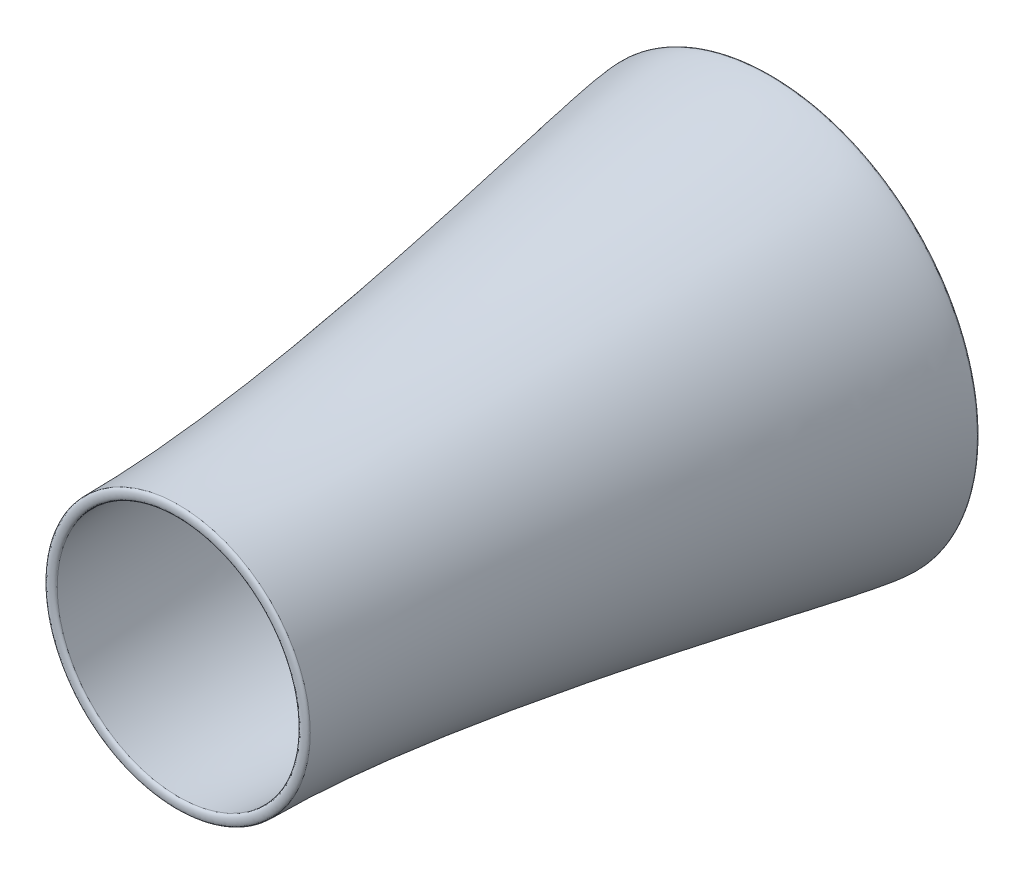
ISO-10303-21;
HEADER;
FILE_DESCRIPTION(('STEP AP214'),'2;1');
FILE_NAME('part.step','',(''),(''),'','','');
FILE_SCHEMA(('AUTOMOTIVE_DESIGN { 1 0 10303 214 1 1 1 1 }'));
ENDSEC;
DATA;
#1=APPLICATION_CONTEXT('core data for automotive mechanical design processes');
#2=APPLICATION_PROTOCOL_DEFINITION('international standard','automotive_design',2000,#1);
#3=PRODUCT_CONTEXT('',#1,'mechanical');
#4=PRODUCT('Part','Part','',(#3));
#5=PRODUCT_RELATED_PRODUCT_CATEGORY('part','',(#4));
#6=PRODUCT_DEFINITION_FORMATION('','',#4);
#7=PRODUCT_DEFINITION_CONTEXT('part definition',#1,'design');
#8=PRODUCT_DEFINITION('design','',#6,#7);
#9=PRODUCT_DEFINITION_SHAPE('','',#8);
#10=(LENGTH_UNIT() NAMED_UNIT(*) SI_UNIT(.MILLI.,.METRE.));
#11=(NAMED_UNIT(*) PLANE_ANGLE_UNIT() SI_UNIT($,.RADIAN.));
#12=(NAMED_UNIT(*) SI_UNIT($,.STERADIAN.) SOLID_ANGLE_UNIT());
#13=UNCERTAINTY_MEASURE_WITH_UNIT(LENGTH_MEASURE(1.E-05),#10,'distance_accuracy_value','');
#14=(GEOMETRIC_REPRESENTATION_CONTEXT(3) GLOBAL_UNCERTAINTY_ASSIGNED_CONTEXT((#13)) GLOBAL_UNIT_ASSIGNED_CONTEXT((#10,
#11,#12)) REPRESENTATION_CONTEXT('',''));
#15=CARTESIAN_POINT('',(0.,0.,0.));
#16=DIRECTION('',(0.,0.,1.));
#17=DIRECTION('',(1.,0.,0.));
#18=AXIS2_PLACEMENT_3D('',#15,#16,#17);
#19=CARTESIAN_POINT('',(-450.143329298044,0.,2018.65939694511));
#20=CARTESIAN_POINT('',(-450.143329298044,0.,2031.35939694511));
#21=CARTESIAN_POINT('',(-414.489662378919,0.,2031.35939694511));
#22=CARTESIAN_POINT('',(-414.489662378919,0.,2018.65939694511));
#23=B_SPLINE_CURVE_WITH_KNOTS('',3,(#19,#20,#21,#22),.UNSPECIFIED.,.F.,.F.,(4,4),(0.,1.),.UNSPECIFIED.);
#24=CARTESIAN_POINT('',(0.,0.,1104.75683012291));
#25=DIRECTION('',(0.,0.,1.));
#26=AXIS1_PLACEMENT('',#24,#25);
#27=SURFACE_OF_REVOLUTION('',#23,#26);
#28=CARTESIAN_POINT('',(0.,0.,2018.65939694511));
#29=DIRECTION('',(0.,0.,1.));
#30=DIRECTION('',(1.,0.,0.));
#31=AXIS2_PLACEMENT_3D('',#28,#29,#30);
#32=CIRCLE('',#31,414.489662378919);
#33=CARTESIAN_POINT('',(414.489662378919,0.,2018.65939694511));
#34=VERTEX_POINT('',#33);
#35=EDGE_CURVE('E47',#34,#34,#32,.T.);
#36=ORIENTED_EDGE('',*,*,#35,.F.);
#37=EDGE_LOOP('',(#36));
#38=FACE_BOUND('',#37,.T.);
#39=CARTESIAN_POINT('',(0.,0.,2018.65939694511));
#40=DIRECTION('',(0.,0.,1.));
#41=DIRECTION('',(1.,0.,0.));
#42=AXIS2_PLACEMENT_3D('',#39,#40,#41);
#43=CIRCLE('',#42,450.143329298044);
#44=CARTESIAN_POINT('',(450.143329298044,0.,2018.65939694511));
#45=VERTEX_POINT('',#44);
#46=EDGE_CURVE('E11',#45,#45,#43,.T.);
#47=ORIENTED_EDGE('',*,*,#46,.T.);
#48=EDGE_LOOP('',(#47));
#49=FACE_BOUND('',#48,.T.);
#50=ADVANCED_FACE('F40',(#38,#49),#27,.T.);
#51=CARTESIAN_POINT('',(-450.143329298044,0.,2018.65939694511));
#52=DIRECTION('',(0.,0.,1.));
#53=DIRECTION('',(1.,0.,0.));
#54=AXIS2_PLACEMENT_3D('',#51,#52,#53);
#55=PLANE('',#54);
#56=ORIENTED_EDGE('',*,*,#46,.F.);
#57=EDGE_LOOP('',(#56));
#58=FACE_BOUND('',#57,.T.);
#59=ORIENTED_EDGE('',*,*,#35,.T.);
#60=EDGE_LOOP('',(#59));
#61=FACE_BOUND('',#60,.T.);
#62=ADVANCED_FACE('F59',(#58,#61),#55,.F.);
#63=CLOSED_SHELL('',(#50,#62));
#64=MANIFOLD_SOLID_BREP('B2',#63);
#65=CARTESIAN_POINT('',(-622.148368511565,0.,0.89375987334962));
#66=CARTESIAN_POINT('',(-622.148368511565,0.,-16.0395734599839));
#67=CARTESIAN_POINT('',(-711.609923736489,0.,-16.0395734599837));
#68=CARTESIAN_POINT('',(-711.609923736489,0.,0.893759873349609));
#69=B_SPLINE_CURVE_WITH_KNOTS('',3,(#65,#66,#67,#68),.UNSPECIFIED.,.F.,.F.,(4,4),(0.,1.),.UNSPECIFIED.);
#70=CARTESIAN_POINT('',(0.,0.,99.6847843209707));
#71=DIRECTION('',(0.,0.,1.));
#72=AXIS1_PLACEMENT('',#70,#71);
#73=SURFACE_OF_REVOLUTION('',#69,#72);
#74=CARTESIAN_POINT('',(0.,0.,0.893759873349609));
#75=DIRECTION('',(0.,0.,1.));
#76=DIRECTION('',(1.,0.,0.));
#77=AXIS2_PLACEMENT_3D('',#74,#75,#76);
#78=CIRCLE('',#77,711.609923736489);
#79=CARTESIAN_POINT('',(711.609923736489,0.,0.893759873349609));
#80=VERTEX_POINT('',#79);
#81=EDGE_CURVE('E39',#80,#80,#78,.T.);
#82=ORIENTED_EDGE('',*,*,#81,.F.);
#83=EDGE_LOOP('',(#82));
#84=FACE_BOUND('',#83,.T.);
#85=CARTESIAN_POINT('',(0.,0.,0.893759873349609));
#86=DIRECTION('',(0.,0.,1.));
#87=DIRECTION('',(1.,0.,0.));
#88=AXIS2_PLACEMENT_3D('',#85,#86,#87);
#89=CIRCLE('',#88,622.148368511565);
#90=CARTESIAN_POINT('',(622.148368511565,0.,0.893759873349609));
#91=VERTEX_POINT('',#90);
#92=EDGE_CURVE('E93',#91,#91,#89,.T.);
#93=ORIENTED_EDGE('',*,*,#92,.T.);
#94=EDGE_LOOP('',(#93));
#95=FACE_BOUND('',#94,.T.);
#96=ADVANCED_FACE('F86',(#84,#95),#73,.T.);
#97=CARTESIAN_POINT('',(-711.609923736489,0.,0.893759873349609));
#98=DIRECTION('',(0.,0.,-1.));
#99=DIRECTION('',(-1.,0.,0.));
#100=AXIS2_PLACEMENT_3D('',#97,#98,#99);
#101=PLANE('',#100);
#102=ORIENTED_EDGE('',*,*,#92,.F.);
#103=EDGE_LOOP('',(#102));
#104=FACE_BOUND('',#103,.T.);
#105=ORIENTED_EDGE('',*,*,#81,.T.);
#106=EDGE_LOOP('',(#105));
#107=FACE_BOUND('',#106,.T.);
#108=ADVANCED_FACE('F106',(#104,#107),#101,.F.);
#109=CLOSED_SHELL('',(#96,#108));
#110=MANIFOLD_SOLID_BREP('B6',#109);
#111=CARTESIAN_POINT('',(-414.489662378919,0.,2018.65939694511));
#112=CARTESIAN_POINT('',(-442.50896760527,0.,1553.96029349733));
#113=CARTESIAN_POINT('',(-414.972940265682,0.,786.37524286479));
#114=CARTESIAN_POINT('',(-512.587421424693,0.,283.558787506978));
#115=CARTESIAN_POINT('',(-622.148368511565,0.,0.893759873349609));
#116=B_SPLINE_CURVE_WITH_KNOTS('',3,(#111,#112,#113,#114,#115),.UNSPECIFIED.,.F.,.F.,(4,1,4),
(0.,0.793493092504956,1.),.UNSPECIFIED.);
#117=CARTESIAN_POINT('',(0.,0.,99.6847843209707));
#118=DIRECTION('',(0.,0.,1.));
#119=AXIS1_PLACEMENT('',#117,#118);
#120=SURFACE_OF_REVOLUTION('',#116,#119);
#121=CARTESIAN_POINT('',(0.,0.,0.893759873349609));
#122=DIRECTION('',(0.,0.,1.));
#123=DIRECTION('',(1.,0.,0.));
#124=AXIS2_PLACEMENT_3D('',#121,#122,#123);
#125=CIRCLE('',#124,622.148368511565);
#126=CARTESIAN_POINT('',(622.148368511565,0.,0.893759873349609));
#127=VERTEX_POINT('',#126);
#128=EDGE_CURVE('E85',#127,#127,#125,.T.);
#129=ORIENTED_EDGE('',*,*,#128,.F.);
#130=EDGE_LOOP('',(#129));
#131=FACE_BOUND('',#130,.T.);
#132=CARTESIAN_POINT('',(0.,0.,2018.65939694511));
#133=DIRECTION('',(0.,0.,1.));
#134=DIRECTION('',(1.,0.,0.));
#135=AXIS2_PLACEMENT_3D('',#132,#133,#134);
#136=CIRCLE('',#135,414.489662378919);
#137=CARTESIAN_POINT('',(414.489662378919,0.,2018.65939694511));
#138=VERTEX_POINT('',#137);
#139=EDGE_CURVE('E140',#138,#138,#136,.T.);
#140=ORIENTED_EDGE('',*,*,#139,.T.);
#141=EDGE_LOOP('',(#140));
#142=FACE_BOUND('',#141,.T.);
#143=ADVANCED_FACE('F125',(#131,#142),#120,.T.);
#144=CARTESIAN_POINT('',(-622.148368511565,0.,0.893759873349609));
#145=DIRECTION('',(0.,0.,1.));
#146=DIRECTION('',(1.,0.,0.));
#147=AXIS2_PLACEMENT_3D('',#144,#145,#146);
#148=PLANE('',#147);
#149=CARTESIAN_POINT('',(0.,0.,0.893759873349609));
#150=DIRECTION('',(0.,0.,1.));
#151=DIRECTION('',(1.,0.,0.));
#152=AXIS2_PLACEMENT_3D('',#149,#150,#151);
#153=CIRCLE('',#152,711.609923736489);
#154=CARTESIAN_POINT('',(711.609923736489,0.,0.893759873349609));
#155=VERTEX_POINT('',#154);
#156=EDGE_CURVE('E132',#155,#155,#153,.T.);
#157=ORIENTED_EDGE('',*,*,#156,.F.);
#158=EDGE_LOOP('',(#157));
#159=FACE_BOUND('',#158,.T.);
#160=ORIENTED_EDGE('',*,*,#128,.T.);
#161=EDGE_LOOP('',(#160));
#162=FACE_BOUND('',#161,.T.);
#163=ADVANCED_FACE('F159',(#159,#162),#148,.F.);
#164=CARTESIAN_POINT('',(-711.609923736489,0.,0.89375987334962));
#165=CARTESIAN_POINT('',(-711.609923736489,0.,126.277712249642));
#166=CARTESIAN_POINT('',(-450.143329298043,0.,1288.35027655987));
#167=CARTESIAN_POINT('',(-450.143329298044,0.,2018.65939694511));
#168=B_SPLINE_CURVE_WITH_KNOTS('',3,(#164,#165,#166,#167),.UNSPECIFIED.,.F.,.F.,(4,4),(0.,1.),.UNSPECIFIED.);
#169=CARTESIAN_POINT('',(0.,0.,99.6847843209707));
#170=DIRECTION('',(0.,0.,1.));
#171=AXIS1_PLACEMENT('',#169,#170);
#172=SURFACE_OF_REVOLUTION('',#168,#171);
#173=CARTESIAN_POINT('',(0.,0.,2018.65939694511));
#174=DIRECTION('',(0.,0.,1.));
#175=DIRECTION('',(1.,0.,0.));
#176=AXIS2_PLACEMENT_3D('',#173,#174,#175);
#177=CIRCLE('',#176,450.143329298044);
#178=CARTESIAN_POINT('',(450.143329298044,0.,2018.65939694511));
#179=VERTEX_POINT('',#178);
#180=EDGE_CURVE('E136',#179,#179,#177,.T.);
#181=ORIENTED_EDGE('',*,*,#180,.F.);
#182=EDGE_LOOP('',(#181));
#183=FACE_BOUND('',#182,.T.);
#184=ORIENTED_EDGE('',*,*,#156,.T.);
#185=EDGE_LOOP('',(#184));
#186=FACE_BOUND('',#185,.T.);
#187=ADVANCED_FACE('F155',(#183,#186),#172,.T.);
#188=CARTESIAN_POINT('',(-414.489662378919,0.,2018.65939694511));
#189=DIRECTION('',(0.,0.,-1.));
#190=DIRECTION('',(-1.,0.,0.));
#191=AXIS2_PLACEMENT_3D('',#188,#189,#190);
#192=PLANE('',#191);
#193=ORIENTED_EDGE('',*,*,#139,.F.);
#194=EDGE_LOOP('',(#193));
#195=FACE_BOUND('',#194,.T.);
#196=ORIENTED_EDGE('',*,*,#180,.T.);
#197=EDGE_LOOP('',(#196));
#198=FACE_BOUND('',#197,.T.);
#199=ADVANCED_FACE('F158',(#195,#198),#192,.F.);
#200=CLOSED_SHELL('',(#143,#163,#187,#199));
#201=MANIFOLD_SOLID_BREP('B34',#200);
#202=ADVANCED_BREP_SHAPE_REPRESENTATION('',(#18,#64,#110,#201),#14);
#203=SHAPE_DEFINITION_REPRESENTATION(#9,#202);
ENDSEC;
END-ISO-10303-21;
